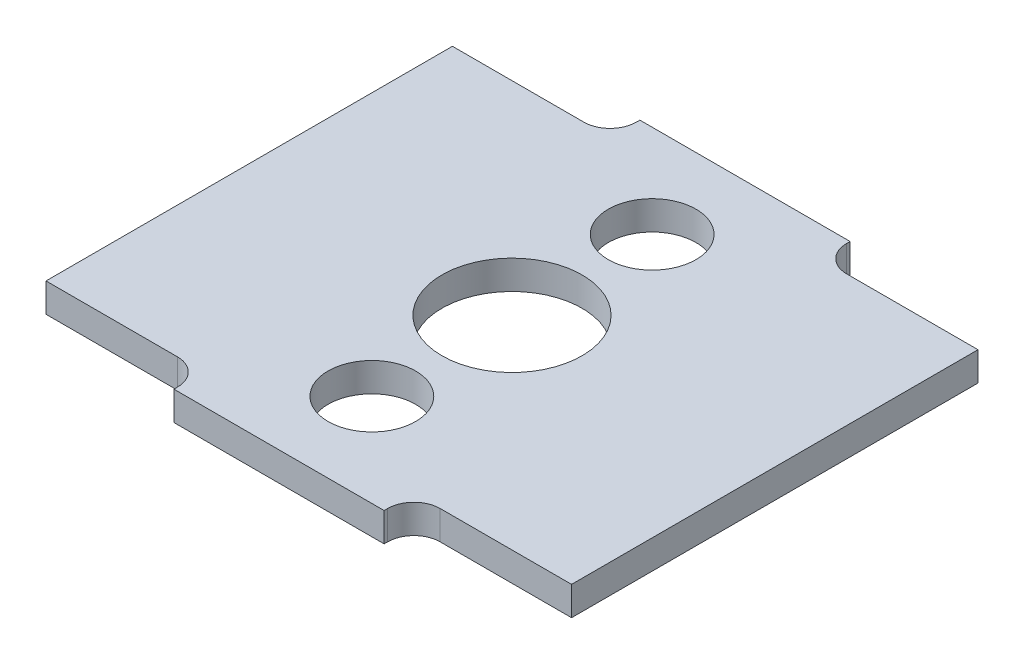
ISO-10303-21;
HEADER;
FILE_DESCRIPTION(('STEP AP214'),'2;1');
FILE_NAME('part.step','',(''),(''),'','','');
FILE_SCHEMA(('AUTOMOTIVE_DESIGN { 1 0 10303 214 1 1 1 1 }'));
ENDSEC;
DATA;
#1=APPLICATION_CONTEXT('core data for automotive mechanical design processes');
#2=APPLICATION_PROTOCOL_DEFINITION('international standard','automotive_design',2000,#1);
#3=PRODUCT_CONTEXT('',#1,'mechanical');
#4=PRODUCT('Part','Part','',(#3));
#5=PRODUCT_RELATED_PRODUCT_CATEGORY('part','',(#4));
#6=PRODUCT_DEFINITION_FORMATION('','',#4);
#7=PRODUCT_DEFINITION_CONTEXT('part definition',#1,'design');
#8=PRODUCT_DEFINITION('design','',#6,#7);
#9=PRODUCT_DEFINITION_SHAPE('','',#8);
#10=(LENGTH_UNIT() NAMED_UNIT(*) SI_UNIT(.MILLI.,.METRE.));
#11=(NAMED_UNIT(*) PLANE_ANGLE_UNIT() SI_UNIT($,.RADIAN.));
#12=(NAMED_UNIT(*) SI_UNIT($,.STERADIAN.) SOLID_ANGLE_UNIT());
#13=UNCERTAINTY_MEASURE_WITH_UNIT(LENGTH_MEASURE(1.E-05),#10,'distance_accuracy_value','');
#14=(GEOMETRIC_REPRESENTATION_CONTEXT(3) GLOBAL_UNCERTAINTY_ASSIGNED_CONTEXT((#13)) GLOBAL_UNIT_ASSIGNED_CONTEXT((#10,
#11,#12)) REPRESENTATION_CONTEXT('',''));
#15=CARTESIAN_POINT('',(0.,0.,0.));
#16=DIRECTION('',(0.,0.,1.));
#17=DIRECTION('',(1.,0.,0.));
#18=AXIS2_PLACEMENT_3D('',#15,#16,#17);
#19=CARTESIAN_POINT('',(-6.00000000000002,-0.825,0.));
#20=DIRECTION('',(1.,0.,0.));
#21=DIRECTION('',(0.,0.,-1.));
#22=AXIS2_PLACEMENT_3D('',#19,#20,#21);
#23=PLANE('',#22);
#24=DIRECTION('',(0.,0.,-1.));
#25=VECTOR('',#24,1.);
#26=CARTESIAN_POINT('',(-6.00000000000002,0.825,0.));
#27=LINE('',#26,#25);
#28=CARTESIAN_POINT('',(-6.,0.825,13.3));
#29=VERTEX_POINT('',#28);
#30=CARTESIAN_POINT('',(-6.,0.825,13.1));
#31=VERTEX_POINT('',#30);
#32=EDGE_CURVE('E203',#29,#31,#27,.T.);
#33=ORIENTED_EDGE('',*,*,#32,.T.);
#34=DIRECTION('',(0.,1.,0.));
#35=VECTOR('',#34,1.);
#36=CARTESIAN_POINT('',(-6.,-0.825,13.1));
#37=LINE('',#36,#35);
#38=CARTESIAN_POINT('',(-6.,-0.825,13.1));
#39=VERTEX_POINT('',#38);
#40=EDGE_CURVE('E170',#31,#39,#37,.F.);
#41=ORIENTED_EDGE('',*,*,#40,.T.);
#42=DIRECTION('',(0.,0.,-1.));
#43=VECTOR('',#42,1.);
#44=CARTESIAN_POINT('',(-6.00000000000002,-0.825,0.));
#45=LINE('',#44,#43);
#46=CARTESIAN_POINT('',(-6.,-0.825,13.3));
#47=VERTEX_POINT('',#46);
#48=EDGE_CURVE('E168',#47,#39,#45,.T.);
#49=ORIENTED_EDGE('',*,*,#48,.F.);
#50=DIRECTION('',(0.,1.,0.));
#51=VECTOR('',#50,1.);
#52=CARTESIAN_POINT('',(-6.,-0.825,13.3));
#53=LINE('',#52,#51);
#54=EDGE_CURVE('E154',#47,#29,#53,.T.);
#55=ORIENTED_EDGE('',*,*,#54,.T.);
#56=EDGE_LOOP('',(#33,#41,#49,#55));
#57=FACE_BOUND('',#56,.T.);
#58=ADVANCED_FACE('F41',(#57),#23,.F.);
#59=CARTESIAN_POINT('',(0.,-0.825,11.6));
#60=DIRECTION('',(0.,0.,-1.));
#61=DIRECTION('',(-1.,0.,0.));
#62=AXIS2_PLACEMENT_3D('',#59,#60,#61);
#63=PLANE('',#62);
#64=DIRECTION('',(-1.,0.,0.));
#65=VECTOR('',#64,1.);
#66=CARTESIAN_POINT('',(0.,-0.825,11.6));
#67=LINE('',#66,#65);
#68=CARTESIAN_POINT('',(-7.5,-0.825,11.6));
#69=VERTEX_POINT('',#68);
#70=CARTESIAN_POINT('',(-15.,-0.825,11.6));
#71=VERTEX_POINT('',#70);
#72=EDGE_CURVE('E165',#69,#71,#67,.T.);
#73=ORIENTED_EDGE('',*,*,#72,.F.);
#74=DIRECTION('',(0.,1.,0.));
#75=VECTOR('',#74,1.);
#76=CARTESIAN_POINT('',(-7.5,0.825,11.6));
#77=LINE('',#76,#75);
#78=CARTESIAN_POINT('',(-7.5,0.825,11.6));
#79=VERTEX_POINT('',#78);
#80=EDGE_CURVE('E232',#69,#79,#77,.T.);
#81=ORIENTED_EDGE('',*,*,#80,.T.);
#82=DIRECTION('',(-1.,0.,0.));
#83=VECTOR('',#82,1.);
#84=CARTESIAN_POINT('',(0.,0.825,11.6));
#85=LINE('',#84,#83);
#86=CARTESIAN_POINT('',(-15.,0.825,11.6));
#87=VERTEX_POINT('',#86);
#88=EDGE_CURVE('E173',#79,#87,#85,.T.);
#89=ORIENTED_EDGE('',*,*,#88,.T.);
#90=DIRECTION('',(0.,1.,0.));
#91=VECTOR('',#90,1.);
#92=CARTESIAN_POINT('',(-15.,-0.825,11.6));
#93=LINE('',#92,#91);
#94=EDGE_CURVE('E229',#71,#87,#93,.T.);
#95=ORIENTED_EDGE('',*,*,#94,.F.);
#96=EDGE_LOOP('',(#73,#81,#89,#95));
#97=FACE_BOUND('',#96,.T.);
#98=ADVANCED_FACE('F332',(#97),#63,.F.);
#99=CARTESIAN_POINT('',(-15.,-0.825,0.));
#100=DIRECTION('',(-1.,0.,0.));
#101=DIRECTION('',(0.,0.,1.));
#102=AXIS2_PLACEMENT_3D('',#99,#100,#101);
#103=PLANE('',#102);
#104=DIRECTION('',(0.,0.,1.));
#105=VECTOR('',#104,1.);
#106=CARTESIAN_POINT('',(-15.,0.825,0.));
#107=LINE('',#106,#105);
#108=CARTESIAN_POINT('',(-15.,0.825,-11.6));
#109=VERTEX_POINT('',#108);
#110=EDGE_CURVE('E225',#109,#87,#107,.T.);
#111=ORIENTED_EDGE('',*,*,#110,.F.);
#112=DIRECTION('',(0.,1.,0.));
#113=VECTOR('',#112,1.);
#114=CARTESIAN_POINT('',(-15.,-0.825,-11.6));
#115=LINE('',#114,#113);
#116=CARTESIAN_POINT('',(-15.,-0.825,-11.6));
#117=VERTEX_POINT('',#116);
#118=EDGE_CURVE('E233',#117,#109,#115,.T.);
#119=ORIENTED_EDGE('',*,*,#118,.F.);
#120=DIRECTION('',(0.,0.,1.));
#121=VECTOR('',#120,1.);
#122=CARTESIAN_POINT('',(-15.,-0.825,0.));
#123=LINE('',#122,#121);
#124=EDGE_CURVE('E199',#117,#71,#123,.T.);
#125=ORIENTED_EDGE('',*,*,#124,.T.);
#126=ORIENTED_EDGE('',*,*,#94,.T.);
#127=EDGE_LOOP('',(#111,#119,#125,#126));
#128=FACE_BOUND('',#127,.T.);
#129=ADVANCED_FACE('F327',(#128),#103,.T.);
#130=CARTESIAN_POINT('',(0.,-0.825,-11.6));
#131=DIRECTION('',(0.,0.,-1.));
#132=DIRECTION('',(-1.,0.,0.));
#133=AXIS2_PLACEMENT_3D('',#130,#131,#132);
#134=PLANE('',#133);
#135=DIRECTION('',(-1.,0.,0.));
#136=VECTOR('',#135,1.);
#137=CARTESIAN_POINT('',(0.,0.825,-11.6));
#138=LINE('',#137,#136);
#139=CARTESIAN_POINT('',(-7.5,0.825,-11.6));
#140=VERTEX_POINT('',#139);
#141=EDGE_CURVE('E223',#140,#109,#138,.T.);
#142=ORIENTED_EDGE('',*,*,#141,.F.);
#143=DIRECTION('',(0.,1.,0.));
#144=VECTOR('',#143,1.);
#145=CARTESIAN_POINT('',(-7.5,-0.825,-11.6));
#146=LINE('',#145,#144);
#147=CARTESIAN_POINT('',(-7.5,-0.825,-11.6));
#148=VERTEX_POINT('',#147);
#149=EDGE_CURVE('E255',#140,#148,#146,.F.);
#150=ORIENTED_EDGE('',*,*,#149,.T.);
#151=DIRECTION('',(-1.,0.,0.));
#152=VECTOR('',#151,1.);
#153=CARTESIAN_POINT('',(0.,-0.825,-11.6));
#154=LINE('',#153,#152);
#155=EDGE_CURVE('E197',#148,#117,#154,.T.);
#156=ORIENTED_EDGE('',*,*,#155,.T.);
#157=ORIENTED_EDGE('',*,*,#118,.T.);
#158=EDGE_LOOP('',(#142,#150,#156,#157));
#159=FACE_BOUND('',#158,.T.);
#160=ADVANCED_FACE('F321',(#159),#134,.T.);
#161=CARTESIAN_POINT('',(-5.99999999999998,-0.825,0.));
#162=DIRECTION('',(1.,0.,0.));
#163=DIRECTION('',(0.,0.,-1.));
#164=AXIS2_PLACEMENT_3D('',#161,#162,#163);
#165=PLANE('',#164);
#166=DIRECTION('',(0.,0.,-1.));
#167=VECTOR('',#166,1.);
#168=CARTESIAN_POINT('',(-5.99999999999998,-0.825,0.));
#169=LINE('',#168,#167);
#170=CARTESIAN_POINT('',(-6.,-0.825,-13.1));
#171=VERTEX_POINT('',#170);
#172=CARTESIAN_POINT('',(-6.,-0.825,-13.3));
#173=VERTEX_POINT('',#172);
#174=EDGE_CURVE('E195',#171,#173,#169,.T.);
#175=ORIENTED_EDGE('',*,*,#174,.F.);
#176=DIRECTION('',(0.,1.,0.));
#177=VECTOR('',#176,1.);
#178=CARTESIAN_POINT('',(-6.,-0.825,-13.1));
#179=LINE('',#178,#177);
#180=CARTESIAN_POINT('',(-6.,0.825,-13.1));
#181=VERTEX_POINT('',#180);
#182=EDGE_CURVE('E252',#171,#181,#179,.T.);
#183=ORIENTED_EDGE('',*,*,#182,.T.);
#184=DIRECTION('',(0.,0.,-1.));
#185=VECTOR('',#184,1.);
#186=CARTESIAN_POINT('',(-5.99999999999998,0.825,0.));
#187=LINE('',#186,#185);
#188=CARTESIAN_POINT('',(-6.,0.825,-13.3));
#189=VERTEX_POINT('',#188);
#190=EDGE_CURVE('E221',#181,#189,#187,.T.);
#191=ORIENTED_EDGE('',*,*,#190,.T.);
#192=DIRECTION('',(0.,1.,0.));
#193=VECTOR('',#192,1.);
#194=CARTESIAN_POINT('',(-6.,-0.825,-13.3));
#195=LINE('',#194,#193);
#196=EDGE_CURVE('E236',#173,#189,#195,.T.);
#197=ORIENTED_EDGE('',*,*,#196,.F.);
#198=EDGE_LOOP('',(#175,#183,#191,#197));
#199=FACE_BOUND('',#198,.T.);
#200=ADVANCED_FACE('F313',(#199),#165,.F.);
#201=CARTESIAN_POINT('',(0.,-0.825,-13.3));
#202=DIRECTION('',(0.,0.,1.));
#203=DIRECTION('',(1.,0.,0.));
#204=AXIS2_PLACEMENT_3D('',#201,#202,#203);
#205=PLANE('',#204);
#206=DIRECTION('',(1.,0.,0.));
#207=VECTOR('',#206,1.);
#208=CARTESIAN_POINT('',(0.,0.825,-13.3));
#209=LINE('',#208,#207);
#210=CARTESIAN_POINT('',(6.,0.825,-13.3));
#211=VERTEX_POINT('',#210);
#212=EDGE_CURVE('E219',#189,#211,#209,.T.);
#213=ORIENTED_EDGE('',*,*,#212,.T.);
#214=DIRECTION('',(0.,1.,0.));
#215=VECTOR('',#214,1.);
#216=CARTESIAN_POINT('',(6.,-0.825,-13.3));
#217=LINE('',#216,#215);
#218=CARTESIAN_POINT('',(6.,-0.825,-13.3));
#219=VERTEX_POINT('',#218);
#220=EDGE_CURVE('E239',#219,#211,#217,.T.);
#221=ORIENTED_EDGE('',*,*,#220,.F.);
#222=DIRECTION('',(1.,0.,0.));
#223=VECTOR('',#222,1.);
#224=CARTESIAN_POINT('',(0.,-0.825,-13.3));
#225=LINE('',#224,#223);
#226=EDGE_CURVE('E193',#173,#219,#225,.T.);
#227=ORIENTED_EDGE('',*,*,#226,.F.);
#228=ORIENTED_EDGE('',*,*,#196,.T.);
#229=EDGE_LOOP('',(#213,#221,#227,#228));
#230=FACE_BOUND('',#229,.T.);
#231=ADVANCED_FACE('F309',(#230),#205,.F.);
#232=CARTESIAN_POINT('',(6.00000000000004,-0.825,0.));
#233=DIRECTION('',(-1.,0.,0.));
#234=DIRECTION('',(0.,0.,1.));
#235=AXIS2_PLACEMENT_3D('',#232,#233,#234);
#236=PLANE('',#235);
#237=DIRECTION('',(0.,0.,1.));
#238=VECTOR('',#237,1.);
#239=CARTESIAN_POINT('',(6.00000000000004,0.825,0.));
#240=LINE('',#239,#238);
#241=CARTESIAN_POINT('',(6.,0.825,-13.1));
#242=VERTEX_POINT('',#241);
#243=EDGE_CURVE('E217',#211,#242,#240,.T.);
#244=ORIENTED_EDGE('',*,*,#243,.T.);
#245=DIRECTION('',(0.,1.,0.));
#246=VECTOR('',#245,1.);
#247=CARTESIAN_POINT('',(6.,-0.825,-13.1));
#248=LINE('',#247,#246);
#249=CARTESIAN_POINT('',(6.,-0.825,-13.1));
#250=VERTEX_POINT('',#249);
#251=EDGE_CURVE('E56',#242,#250,#248,.F.);
#252=ORIENTED_EDGE('',*,*,#251,.T.);
#253=DIRECTION('',(0.,0.,1.));
#254=VECTOR('',#253,1.);
#255=CARTESIAN_POINT('',(6.00000000000004,-0.825,0.));
#256=LINE('',#255,#254);
#257=EDGE_CURVE('E191',#219,#250,#256,.T.);
#258=ORIENTED_EDGE('',*,*,#257,.F.);
#259=ORIENTED_EDGE('',*,*,#220,.T.);
#260=EDGE_LOOP('',(#244,#252,#258,#259));
#261=FACE_BOUND('',#260,.T.);
#262=ADVANCED_FACE('F305',(#261),#236,.F.);
#263=CARTESIAN_POINT('',(0.,-0.825,-11.6));
#264=DIRECTION('',(0.,0.,1.));
#265=DIRECTION('',(1.,0.,0.));
#266=AXIS2_PLACEMENT_3D('',#263,#264,#265);
#267=PLANE('',#266);
#268=DIRECTION('',(1.,0.,0.));
#269=VECTOR('',#268,1.);
#270=CARTESIAN_POINT('',(0.,-0.825,-11.6));
#271=LINE('',#270,#269);
#272=CARTESIAN_POINT('',(7.5,-0.825,-11.6));
#273=VERTEX_POINT('',#272);
#274=CARTESIAN_POINT('',(15.,-0.825,-11.6));
#275=VERTEX_POINT('',#274);
#276=EDGE_CURVE('E189',#273,#275,#271,.T.);
#277=ORIENTED_EDGE('',*,*,#276,.F.);
#278=DIRECTION('',(0.,1.,0.));
#279=VECTOR('',#278,1.);
#280=CARTESIAN_POINT('',(7.5,0.825,-11.6));
#281=LINE('',#280,#279);
#282=CARTESIAN_POINT('',(7.5,0.825,-11.6));
#283=VERTEX_POINT('',#282);
#284=EDGE_CURVE('E262',#273,#283,#281,.T.);
#285=ORIENTED_EDGE('',*,*,#284,.T.);
#286=DIRECTION('',(1.,0.,0.));
#287=VECTOR('',#286,1.);
#288=CARTESIAN_POINT('',(0.,0.825,-11.6));
#289=LINE('',#288,#287);
#290=CARTESIAN_POINT('',(15.,0.825,-11.6));
#291=VERTEX_POINT('',#290);
#292=EDGE_CURVE('E215',#283,#291,#289,.T.);
#293=ORIENTED_EDGE('',*,*,#292,.T.);
#294=DIRECTION('',(0.,1.,0.));
#295=VECTOR('',#294,1.);
#296=CARTESIAN_POINT('',(15.,-0.825,-11.6));
#297=LINE('',#296,#295);
#298=EDGE_CURVE('E242',#275,#291,#297,.T.);
#299=ORIENTED_EDGE('',*,*,#298,.F.);
#300=EDGE_LOOP('',(#277,#285,#293,#299));
#301=FACE_BOUND('',#300,.T.);
#302=ADVANCED_FACE('F299',(#301),#267,.F.);
#303=CARTESIAN_POINT('',(15.,-0.825,0.));
#304=DIRECTION('',(-1.,0.,0.));
#305=DIRECTION('',(0.,0.,1.));
#306=AXIS2_PLACEMENT_3D('',#303,#304,#305);
#307=PLANE('',#306);
#308=DIRECTION('',(0.,0.,1.));
#309=VECTOR('',#308,1.);
#310=CARTESIAN_POINT('',(15.,0.825,0.));
#311=LINE('',#310,#309);
#312=CARTESIAN_POINT('',(15.,0.825,11.6));
#313=VERTEX_POINT('',#312);
#314=EDGE_CURVE('E212',#291,#313,#311,.T.);
#315=ORIENTED_EDGE('',*,*,#314,.T.);
#316=DIRECTION('',(0.,1.,0.));
#317=VECTOR('',#316,1.);
#318=CARTESIAN_POINT('',(15.,-0.825,11.6));
#319=LINE('',#318,#317);
#320=CARTESIAN_POINT('',(15.,-0.825,11.6));
#321=VERTEX_POINT('',#320);
#322=EDGE_CURVE('E245',#321,#313,#319,.T.);
#323=ORIENTED_EDGE('',*,*,#322,.F.);
#324=DIRECTION('',(0.,0.,1.));
#325=VECTOR('',#324,1.);
#326=CARTESIAN_POINT('',(15.,-0.825,0.));
#327=LINE('',#326,#325);
#328=EDGE_CURVE('E186',#275,#321,#327,.T.);
#329=ORIENTED_EDGE('',*,*,#328,.F.);
#330=ORIENTED_EDGE('',*,*,#298,.T.);
#331=EDGE_LOOP('',(#315,#323,#329,#330));
#332=FACE_BOUND('',#331,.T.);
#333=ADVANCED_FACE('F295',(#332),#307,.F.);
#334=CARTESIAN_POINT('',(0.,-0.825,11.6));
#335=DIRECTION('',(0.,0.,1.));
#336=DIRECTION('',(1.,0.,0.));
#337=AXIS2_PLACEMENT_3D('',#334,#335,#336);
#338=PLANE('',#337);
#339=DIRECTION('',(1.,0.,0.));
#340=VECTOR('',#339,1.);
#341=CARTESIAN_POINT('',(0.,0.825,11.6));
#342=LINE('',#341,#340);
#343=CARTESIAN_POINT('',(7.5,0.825,11.6));
#344=VERTEX_POINT('',#343);
#345=EDGE_CURVE('E210',#344,#313,#342,.T.);
#346=ORIENTED_EDGE('',*,*,#345,.F.);
#347=DIRECTION('',(0.,1.,0.));
#348=VECTOR('',#347,1.);
#349=CARTESIAN_POINT('',(7.5,-0.825,11.6));
#350=LINE('',#349,#348);
#351=CARTESIAN_POINT('',(7.5,-0.825,11.6));
#352=VERTEX_POINT('',#351);
#353=EDGE_CURVE('E260',#344,#352,#350,.F.);
#354=ORIENTED_EDGE('',*,*,#353,.T.);
#355=DIRECTION('',(1.,0.,0.));
#356=VECTOR('',#355,1.);
#357=CARTESIAN_POINT('',(0.,-0.825,11.6));
#358=LINE('',#357,#356);
#359=EDGE_CURVE('E181',#352,#321,#358,.T.);
#360=ORIENTED_EDGE('',*,*,#359,.T.);
#361=ORIENTED_EDGE('',*,*,#322,.T.);
#362=EDGE_LOOP('',(#346,#354,#360,#361));
#363=FACE_BOUND('',#362,.T.);
#364=ADVANCED_FACE('F291',(#363),#338,.T.);
#365=CARTESIAN_POINT('',(6.00000000000002,-0.825,0.));
#366=DIRECTION('',(1.,0.,0.));
#367=DIRECTION('',(0.,0.,-1.));
#368=AXIS2_PLACEMENT_3D('',#365,#366,#367);
#369=PLANE('',#368);
#370=DIRECTION('',(0.,0.,-1.));
#371=VECTOR('',#370,1.);
#372=CARTESIAN_POINT('',(6.00000000000002,-0.825,0.));
#373=LINE('',#372,#371);
#374=CARTESIAN_POINT('',(6.,-0.825,13.3));
#375=VERTEX_POINT('',#374);
#376=CARTESIAN_POINT('',(6.,-0.825,13.1));
#377=VERTEX_POINT('',#376);
#378=EDGE_CURVE('E179',#375,#377,#373,.T.);
#379=ORIENTED_EDGE('',*,*,#378,.T.);
#380=DIRECTION('',(0.,1.,0.));
#381=VECTOR('',#380,1.);
#382=CARTESIAN_POINT('',(6.,0.825,13.1));
#383=LINE('',#382,#381);
#384=CARTESIAN_POINT('',(6.,0.825,13.1));
#385=VERTEX_POINT('',#384);
#386=EDGE_CURVE('E257',#377,#385,#383,.T.);
#387=ORIENTED_EDGE('',*,*,#386,.T.);
#388=DIRECTION('',(0.,0.,-1.));
#389=VECTOR('',#388,1.);
#390=CARTESIAN_POINT('',(6.00000000000002,0.825,0.));
#391=LINE('',#390,#389);
#392=CARTESIAN_POINT('',(6.,0.825,13.3));
#393=VERTEX_POINT('',#392);
#394=EDGE_CURVE('E207',#393,#385,#391,.T.);
#395=ORIENTED_EDGE('',*,*,#394,.F.);
#396=DIRECTION('',(0.,1.,0.));
#397=VECTOR('',#396,1.);
#398=CARTESIAN_POINT('',(6.,-0.825,13.3));
#399=LINE('',#398,#397);
#400=EDGE_CURVE('E164',#375,#393,#399,.T.);
#401=ORIENTED_EDGE('',*,*,#400,.F.);
#402=EDGE_LOOP('',(#379,#387,#395,#401));
#403=FACE_BOUND('',#402,.T.);
#404=ADVANCED_FACE('F283',(#403),#369,.T.);
#405=CARTESIAN_POINT('',(0.,-0.825,13.3));
#406=DIRECTION('',(0.,0.,1.));
#407=DIRECTION('',(1.,0.,0.));
#408=AXIS2_PLACEMENT_3D('',#405,#406,#407);
#409=PLANE('',#408);
#410=DIRECTION('',(1.,0.,0.));
#411=VECTOR('',#410,1.);
#412=CARTESIAN_POINT('',(0.,0.825,13.3));
#413=LINE('',#412,#411);
#414=EDGE_CURVE('E160',#29,#393,#413,.T.);
#415=ORIENTED_EDGE('',*,*,#414,.F.);
#416=ORIENTED_EDGE('',*,*,#54,.F.);
#417=DIRECTION('',(1.,0.,0.));
#418=VECTOR('',#417,1.);
#419=CARTESIAN_POINT('',(0.,-0.825,13.3));
#420=LINE('',#419,#418);
#421=EDGE_CURVE('E158',#47,#375,#420,.T.);
#422=ORIENTED_EDGE('',*,*,#421,.T.);
#423=ORIENTED_EDGE('',*,*,#400,.T.);
#424=EDGE_LOOP('',(#415,#416,#422,#423));
#425=FACE_BOUND('',#424,.T.);
#426=ADVANCED_FACE('F156',(#425),#409,.T.);
#427=CARTESIAN_POINT('',(0.,-0.825,0.));
#428=DIRECTION('',(0.,1.,0.));
#429=DIRECTION('',(0.,0.,1.));
#430=AXIS2_PLACEMENT_3D('',#427,#428,#429);
#431=PLANE('',#430);
#432=CARTESIAN_POINT('',(0.,-0.825,8.));
#433=DIRECTION('',(0.,1.,0.));
#434=DIRECTION('',(0.,0.,1.));
#435=AXIS2_PLACEMENT_3D('',#432,#433,#434);
#436=CIRCLE('',#435,2.5);
#437=CARTESIAN_POINT('',(0.,-0.825,10.5));
#438=VERTEX_POINT('',#437);
#439=EDGE_CURVE('E391',#438,#438,#436,.T.);
#440=ORIENTED_EDGE('',*,*,#439,.T.);
#441=EDGE_LOOP('',(#440));
#442=FACE_BOUND('',#441,.T.);
#443=CARTESIAN_POINT('',(0.,-0.825,-8.));
#444=DIRECTION('',(0.,1.,0.));
#445=DIRECTION('',(0.,0.,1.));
#446=AXIS2_PLACEMENT_3D('',#443,#444,#445);
#447=CIRCLE('',#446,2.5);
#448=CARTESIAN_POINT('',(0.,-0.825,-5.5));
#449=VERTEX_POINT('',#448);
#450=EDGE_CURVE('E399',#449,#449,#447,.T.);
#451=ORIENTED_EDGE('',*,*,#450,.T.);
#452=EDGE_LOOP('',(#451));
#453=FACE_BOUND('',#452,.T.);
#454=ORIENTED_EDGE('',*,*,#48,.T.);
#455=CARTESIAN_POINT('',(-7.5,-0.825,13.1));
#456=DIRECTION('',(0.,1.,0.));
#457=DIRECTION('',(0.,0.,1.));
#458=AXIS2_PLACEMENT_3D('',#455,#456,#457);
#459=CIRCLE('',#458,1.5);
#460=EDGE_CURVE('E268',#39,#69,#459,.T.);
#461=ORIENTED_EDGE('',*,*,#460,.T.);
#462=ORIENTED_EDGE('',*,*,#72,.T.);
#463=ORIENTED_EDGE('',*,*,#124,.F.);
#464=ORIENTED_EDGE('',*,*,#155,.F.);
#465=CARTESIAN_POINT('',(-7.5,-0.825,-13.1));
#466=DIRECTION('',(0.,1.,0.));
#467=DIRECTION('',(0.,0.,1.));
#468=AXIS2_PLACEMENT_3D('',#465,#466,#467);
#469=CIRCLE('',#468,1.5);
#470=EDGE_CURVE('E272',#148,#171,#469,.T.);
#471=ORIENTED_EDGE('',*,*,#470,.T.);
#472=ORIENTED_EDGE('',*,*,#174,.T.);
#473=ORIENTED_EDGE('',*,*,#226,.T.);
#474=ORIENTED_EDGE('',*,*,#257,.T.);
#475=CARTESIAN_POINT('',(7.5,-0.825,-13.1));
#476=DIRECTION('',(0.,1.,0.));
#477=DIRECTION('',(0.,0.,1.));
#478=AXIS2_PLACEMENT_3D('',#475,#476,#477);
#479=CIRCLE('',#478,1.5);
#480=EDGE_CURVE('E11',#250,#273,#479,.T.);
#481=ORIENTED_EDGE('',*,*,#480,.T.);
#482=ORIENTED_EDGE('',*,*,#276,.T.);
#483=ORIENTED_EDGE('',*,*,#328,.T.);
#484=ORIENTED_EDGE('',*,*,#359,.F.);
#485=CARTESIAN_POINT('',(7.5,-0.825,13.1));
#486=DIRECTION('',(0.,1.,0.));
#487=DIRECTION('',(0.,0.,1.));
#488=AXIS2_PLACEMENT_3D('',#485,#486,#487);
#489=CIRCLE('',#488,1.5);
#490=EDGE_CURVE('E276',#352,#377,#489,.T.);
#491=ORIENTED_EDGE('',*,*,#490,.T.);
#492=ORIENTED_EDGE('',*,*,#378,.F.);
#493=ORIENTED_EDGE('',*,*,#421,.F.);
#494=EDGE_LOOP('',(#454,#461,#462,#463,#464,#471,#472,#473,#474,#481,#482,#483,#484,#491,#492,#493));
#495=FACE_BOUND('',#494,.T.);
#496=CARTESIAN_POINT('',(0.,-0.824999999999999,0.));
#497=DIRECTION('',(0.,1.,0.));
#498=DIRECTION('',(0.,0.,1.));
#499=AXIS2_PLACEMENT_3D('',#496,#497,#498);
#500=CIRCLE('',#499,4.);
#501=CARTESIAN_POINT('',(0.,-0.824999999999999,4.));
#502=VERTEX_POINT('',#501);
#503=EDGE_CURVE('E205',#502,#502,#500,.F.);
#504=ORIENTED_EDGE('',*,*,#503,.F.);
#505=EDGE_LOOP('',(#504));
#506=FACE_BOUND('',#505,.T.);
#507=ADVANCED_FACE('F176',(#442,#453,#495,#506),#431,.F.);
#508=CARTESIAN_POINT('',(0.,0.825,0.));
#509=DIRECTION('',(0.,1.,0.));
#510=DIRECTION('',(0.,0.,1.));
#511=AXIS2_PLACEMENT_3D('',#508,#509,#510);
#512=PLANE('',#511);
#513=CARTESIAN_POINT('',(0.,0.825,8.));
#514=DIRECTION('',(0.,1.,0.));
#515=DIRECTION('',(0.,0.,1.));
#516=AXIS2_PLACEMENT_3D('',#513,#514,#515);
#517=CIRCLE('',#516,2.5);
#518=CARTESIAN_POINT('',(0.,0.825,10.5));
#519=VERTEX_POINT('',#518);
#520=EDGE_CURVE('E394',#519,#519,#517,.T.);
#521=ORIENTED_EDGE('',*,*,#520,.F.);
#522=EDGE_LOOP('',(#521));
#523=FACE_BOUND('',#522,.T.);
#524=CARTESIAN_POINT('',(0.,0.825,-8.));
#525=DIRECTION('',(0.,1.,0.));
#526=DIRECTION('',(0.,0.,1.));
#527=AXIS2_PLACEMENT_3D('',#524,#525,#526);
#528=CIRCLE('',#527,2.5);
#529=CARTESIAN_POINT('',(0.,0.825,-5.5));
#530=VERTEX_POINT('',#529);
#531=EDGE_CURVE('E396',#530,#530,#528,.T.);
#532=ORIENTED_EDGE('',*,*,#531,.F.);
#533=EDGE_LOOP('',(#532));
#534=FACE_BOUND('',#533,.T.);
#535=ORIENTED_EDGE('',*,*,#32,.F.);
#536=ORIENTED_EDGE('',*,*,#414,.T.);
#537=ORIENTED_EDGE('',*,*,#394,.T.);
#538=CARTESIAN_POINT('',(7.5,0.825,13.1));
#539=DIRECTION('',(0.,1.,0.));
#540=DIRECTION('',(0.,0.,1.));
#541=AXIS2_PLACEMENT_3D('',#538,#539,#540);
#542=CIRCLE('',#541,1.5);
#543=EDGE_CURVE('E274',#385,#344,#542,.F.);
#544=ORIENTED_EDGE('',*,*,#543,.T.);
#545=ORIENTED_EDGE('',*,*,#345,.T.);
#546=ORIENTED_EDGE('',*,*,#314,.F.);
#547=ORIENTED_EDGE('',*,*,#292,.F.);
#548=CARTESIAN_POINT('',(7.5,0.825,-13.1));
#549=DIRECTION('',(0.,1.,0.));
#550=DIRECTION('',(0.,0.,1.));
#551=AXIS2_PLACEMENT_3D('',#548,#549,#550);
#552=CIRCLE('',#551,1.5);
#553=EDGE_CURVE('E49',#283,#242,#552,.F.);
#554=ORIENTED_EDGE('',*,*,#553,.T.);
#555=ORIENTED_EDGE('',*,*,#243,.F.);
#556=ORIENTED_EDGE('',*,*,#212,.F.);
#557=ORIENTED_EDGE('',*,*,#190,.F.);
#558=CARTESIAN_POINT('',(-7.5,0.825,-13.1));
#559=DIRECTION('',(0.,1.,0.));
#560=DIRECTION('',(0.,0.,1.));
#561=AXIS2_PLACEMENT_3D('',#558,#559,#560);
#562=CIRCLE('',#561,1.5);
#563=EDGE_CURVE('E270',#181,#140,#562,.F.);
#564=ORIENTED_EDGE('',*,*,#563,.T.);
#565=ORIENTED_EDGE('',*,*,#141,.T.);
#566=ORIENTED_EDGE('',*,*,#110,.T.);
#567=ORIENTED_EDGE('',*,*,#88,.F.);
#568=CARTESIAN_POINT('',(-7.5,0.825,13.1));
#569=DIRECTION('',(0.,1.,0.));
#570=DIRECTION('',(0.,0.,1.));
#571=AXIS2_PLACEMENT_3D('',#568,#569,#570);
#572=CIRCLE('',#571,1.5);
#573=EDGE_CURVE('E266',#79,#31,#572,.F.);
#574=ORIENTED_EDGE('',*,*,#573,.T.);
#575=EDGE_LOOP('',(#535,#536,#537,#544,#545,#546,#547,#554,#555,#556,#557,#564,#565,#566,#567,#574));
#576=FACE_BOUND('',#575,.T.);
#577=CARTESIAN_POINT('',(0.,0.825,0.));
#578=DIRECTION('',(0.,1.,0.));
#579=DIRECTION('',(0.,0.,1.));
#580=AXIS2_PLACEMENT_3D('',#577,#578,#579);
#581=CIRCLE('',#580,4.);
#582=CARTESIAN_POINT('',(0.,0.825,4.));
#583=VERTEX_POINT('',#582);
#584=EDGE_CURVE('E402',#583,#583,#581,.T.);
#585=ORIENTED_EDGE('',*,*,#584,.F.);
#586=EDGE_LOOP('',(#585));
#587=FACE_BOUND('',#586,.T.);
#588=ADVANCED_FACE('F287',(#523,#534,#576,#587),#512,.T.);
#589=CARTESIAN_POINT('',(-7.5,-0.825,13.1));
#590=DIRECTION('',(0.,-1.,0.));
#591=DIRECTION('',(0.,0.,-1.));
#592=AXIS2_PLACEMENT_3D('',#589,#590,#591);
#593=CYLINDRICAL_SURFACE('',#592,1.5);
#594=ORIENTED_EDGE('',*,*,#460,.F.);
#595=ORIENTED_EDGE('',*,*,#40,.F.);
#596=ORIENTED_EDGE('',*,*,#573,.F.);
#597=ORIENTED_EDGE('',*,*,#80,.F.);
#598=EDGE_LOOP('',(#594,#595,#596,#597));
#599=FACE_BOUND('',#598,.T.);
#600=ADVANCED_FACE('F335',(#599),#593,.F.);
#601=CARTESIAN_POINT('',(-7.5,-0.825,-13.1));
#602=DIRECTION('',(0.,1.,0.));
#603=DIRECTION('',(0.,0.,1.));
#604=AXIS2_PLACEMENT_3D('',#601,#602,#603);
#605=CYLINDRICAL_SURFACE('',#604,1.5);
#606=ORIENTED_EDGE('',*,*,#470,.F.);
#607=ORIENTED_EDGE('',*,*,#149,.F.);
#608=ORIENTED_EDGE('',*,*,#563,.F.);
#609=ORIENTED_EDGE('',*,*,#182,.F.);
#610=EDGE_LOOP('',(#606,#607,#608,#609));
#611=FACE_BOUND('',#610,.T.);
#612=ADVANCED_FACE('F317',(#611),#605,.F.);
#613=CARTESIAN_POINT('',(7.5,-0.825,13.1));
#614=DIRECTION('',(0.,-1.,0.));
#615=DIRECTION('',(0.,0.,-1.));
#616=AXIS2_PLACEMENT_3D('',#613,#614,#615);
#617=CYLINDRICAL_SURFACE('',#616,1.5);
#618=ORIENTED_EDGE('',*,*,#490,.F.);
#619=ORIENTED_EDGE('',*,*,#353,.F.);
#620=ORIENTED_EDGE('',*,*,#543,.F.);
#621=ORIENTED_EDGE('',*,*,#386,.F.);
#622=EDGE_LOOP('',(#618,#619,#620,#621));
#623=FACE_BOUND('',#622,.T.);
#624=ADVANCED_FACE('F285',(#623),#617,.F.);
#625=CARTESIAN_POINT('',(7.5,-0.825,-13.1));
#626=DIRECTION('',(0.,-1.,0.));
#627=DIRECTION('',(0.,0.,-1.));
#628=AXIS2_PLACEMENT_3D('',#625,#626,#627);
#629=CYLINDRICAL_SURFACE('',#628,1.5);
#630=ORIENTED_EDGE('',*,*,#480,.F.);
#631=ORIENTED_EDGE('',*,*,#251,.F.);
#632=ORIENTED_EDGE('',*,*,#553,.F.);
#633=ORIENTED_EDGE('',*,*,#284,.F.);
#634=EDGE_LOOP('',(#630,#631,#632,#633));
#635=FACE_BOUND('',#634,.T.);
#636=ADVANCED_FACE('F43',(#635),#629,.F.);
#637=CARTESIAN_POINT('',(0.,-14.967135623731,0.));
#638=DIRECTION('',(0.,1.,0.));
#639=DIRECTION('',(0.,0.,1.));
#640=AXIS2_PLACEMENT_3D('',#637,#638,#639);
#641=CYLINDRICAL_SURFACE('',#640,4.);
#642=ORIENTED_EDGE('',*,*,#503,.T.);
#643=EDGE_LOOP('',(#642));
#644=FACE_BOUND('',#643,.T.);
#645=ORIENTED_EDGE('',*,*,#584,.T.);
#646=EDGE_LOOP('',(#645));
#647=FACE_BOUND('',#646,.T.);
#648=ADVANCED_FACE('F375',(#644,#647),#641,.F.);
#649=CARTESIAN_POINT('',(0.,-0.825,-8.));
#650=DIRECTION('',(0.,1.,0.));
#651=DIRECTION('',(0.,0.,1.));
#652=AXIS2_PLACEMENT_3D('',#649,#650,#651);
#653=CYLINDRICAL_SURFACE('',#652,2.5);
#654=ORIENTED_EDGE('',*,*,#450,.F.);
#655=EDGE_LOOP('',(#654));
#656=FACE_BOUND('',#655,.T.);
#657=ORIENTED_EDGE('',*,*,#531,.T.);
#658=EDGE_LOOP('',(#657));
#659=FACE_BOUND('',#658,.T.);
#660=ADVANCED_FACE('F378',(#656,#659),#653,.F.);
#661=CARTESIAN_POINT('',(0.,-0.825,8.));
#662=DIRECTION('',(0.,1.,0.));
#663=DIRECTION('',(0.,0.,1.));
#664=AXIS2_PLACEMENT_3D('',#661,#662,#663);
#665=CYLINDRICAL_SURFACE('',#664,2.5);
#666=ORIENTED_EDGE('',*,*,#439,.F.);
#667=EDGE_LOOP('',(#666));
#668=FACE_BOUND('',#667,.T.);
#669=ORIENTED_EDGE('',*,*,#520,.T.);
#670=EDGE_LOOP('',(#669));
#671=FACE_BOUND('',#670,.T.);
#672=ADVANCED_FACE('F382',(#668,#671),#665,.F.);
#673=CLOSED_SHELL('',(#58,#98,#129,#160,#200,#231,#262,#302,#333,#364,#404,#426,#507,#588,#600,
#612,#624,#636,#648,#660,#672));
#674=MANIFOLD_SOLID_BREP('B2',#673);
#675=ADVANCED_BREP_SHAPE_REPRESENTATION('',(#18,#674),#14);
#676=SHAPE_DEFINITION_REPRESENTATION(#9,#675);
ENDSEC;
END-ISO-10303-21;
